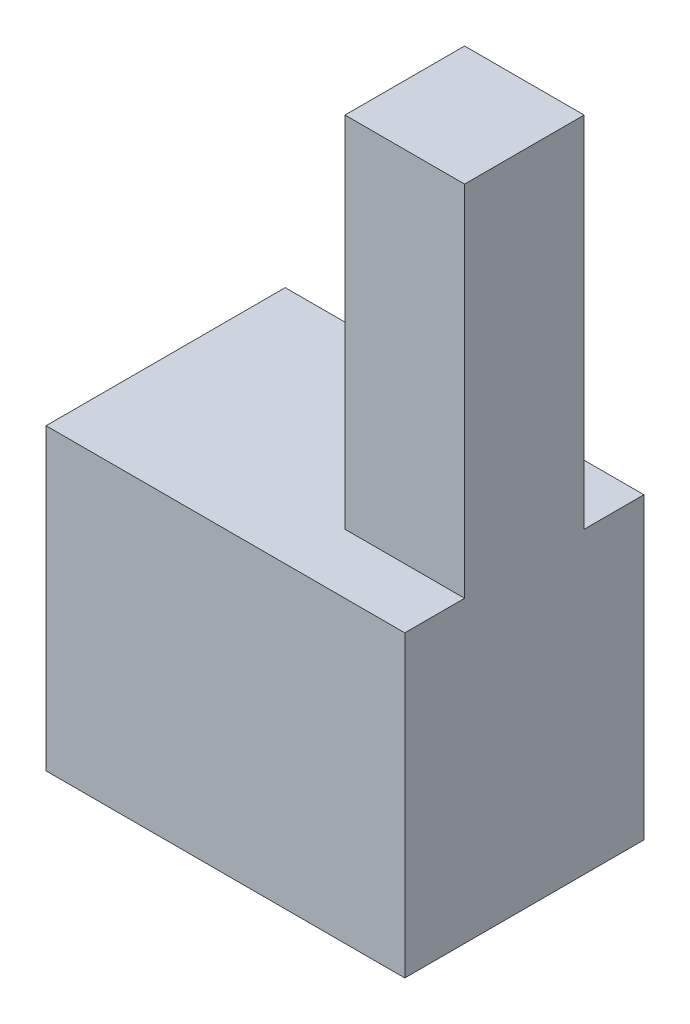
ISO-10303-21;
HEADER;
FILE_DESCRIPTION(('STEP AP214'),'2;1');
FILE_NAME('part.step','',(''),(''),'','','');
FILE_SCHEMA(('AUTOMOTIVE_DESIGN { 1 0 10303 214 1 1 1 1 }'));
ENDSEC;
DATA;
#1=APPLICATION_CONTEXT('core data for automotive mechanical design processes');
#2=APPLICATION_PROTOCOL_DEFINITION('international standard','automotive_design',2000,#1);
#3=PRODUCT_CONTEXT('',#1,'mechanical');
#4=PRODUCT('Part','Part','',(#3));
#5=PRODUCT_RELATED_PRODUCT_CATEGORY('part','',(#4));
#6=PRODUCT_DEFINITION_FORMATION('','',#4);
#7=PRODUCT_DEFINITION_CONTEXT('part definition',#1,'design');
#8=PRODUCT_DEFINITION('design','',#6,#7);
#9=PRODUCT_DEFINITION_SHAPE('','',#8);
#10=(LENGTH_UNIT() NAMED_UNIT(*) SI_UNIT(.MILLI.,.METRE.));
#11=(NAMED_UNIT(*) PLANE_ANGLE_UNIT() SI_UNIT($,.RADIAN.));
#12=(NAMED_UNIT(*) SI_UNIT($,.STERADIAN.) SOLID_ANGLE_UNIT());
#13=UNCERTAINTY_MEASURE_WITH_UNIT(LENGTH_MEASURE(1.E-05),#10,'distance_accuracy_value','');
#14=(GEOMETRIC_REPRESENTATION_CONTEXT(3) GLOBAL_UNCERTAINTY_ASSIGNED_CONTEXT((#13)) GLOBAL_UNIT_ASSIGNED_CONTEXT((#10,
#11,#12)) REPRESENTATION_CONTEXT('',''));
#15=CARTESIAN_POINT('',(0.,0.,0.));
#16=DIRECTION('',(0.,0.,1.));
#17=DIRECTION('',(1.,0.,0.));
#18=AXIS2_PLACEMENT_3D('',#15,#16,#17);
#19=CARTESIAN_POINT('',(0.,0.,0.));
#20=DIRECTION('',(0.,0.,1.));
#21=DIRECTION('',(1.,0.,0.));
#22=AXIS2_PLACEMENT_3D('',#19,#20,#21);
#23=PLANE('',#22);
#24=DIRECTION('',(1.,0.,0.));
#25=VECTOR('',#24,1.);
#26=CARTESIAN_POINT('',(0.,0.,0.));
#27=LINE('',#26,#25);
#28=CARTESIAN_POINT('',(20.,0.,0.));
#29=VERTEX_POINT('',#28);
#30=CARTESIAN_POINT('',(30.,0.,0.));
#31=VERTEX_POINT('',#30);
#32=EDGE_CURVE('E11',#29,#31,#27,.T.);
#33=ORIENTED_EDGE('',*,*,#32,.F.);
#34=DIRECTION('',(0.,-1.,0.));
#35=VECTOR('',#34,1.);
#36=CARTESIAN_POINT('',(20.,0.,0.));
#37=LINE('',#36,#35);
#38=CARTESIAN_POINT('',(20.,30.,0.));
#39=VERTEX_POINT('',#38);
#40=EDGE_CURVE('E145',#39,#29,#37,.T.);
#41=ORIENTED_EDGE('',*,*,#40,.F.);
#42=DIRECTION('',(-1.,0.,0.));
#43=VECTOR('',#42,1.);
#44=CARTESIAN_POINT('',(20.,30.,0.));
#45=LINE('',#44,#43);
#46=CARTESIAN_POINT('',(30.,30.,0.));
#47=VERTEX_POINT('',#46);
#48=EDGE_CURVE('E141',#47,#39,#45,.T.);
#49=ORIENTED_EDGE('',*,*,#48,.F.);
#50=DIRECTION('',(0.,1.,0.));
#51=VECTOR('',#50,1.);
#52=CARTESIAN_POINT('',(30.,30.,0.));
#53=LINE('',#52,#51);
#54=EDGE_CURVE('E123',#31,#47,#53,.T.);
#55=ORIENTED_EDGE('',*,*,#54,.F.);
#56=EDGE_LOOP('',(#33,#41,#49,#55));
#57=FACE_BOUND('',#56,.T.);
#58=ADVANCED_FACE('F47',(#57),#23,.F.);
#59=CARTESIAN_POINT('',(0.,0.,10.));
#60=DIRECTION('',(0.,-1.,0.));
#61=DIRECTION('',(0.,0.,-1.));
#62=AXIS2_PLACEMENT_3D('',#59,#60,#61);
#63=PLANE('',#62);
#64=DIRECTION('',(0.,0.,-1.));
#65=VECTOR('',#64,1.);
#66=CARTESIAN_POINT('',(20.,0.,10.));
#67=LINE('',#66,#65);
#68=CARTESIAN_POINT('',(20.,0.,10.));
#69=VERTEX_POINT('',#68);
#70=EDGE_CURVE('E135',#69,#29,#67,.T.);
#71=ORIENTED_EDGE('',*,*,#70,.T.);
#72=ORIENTED_EDGE('',*,*,#32,.T.);
#73=DIRECTION('',(0.,0.,1.));
#74=VECTOR('',#73,1.);
#75=CARTESIAN_POINT('',(30.,0.,-5.));
#76=LINE('',#75,#74);
#77=CARTESIAN_POINT('',(30.,0.,-5.));
#78=VERTEX_POINT('',#77);
#79=EDGE_CURVE('E194',#78,#31,#76,.T.);
#80=ORIENTED_EDGE('',*,*,#79,.F.);
#81=DIRECTION('',(1.,0.,0.));
#82=VECTOR('',#81,1.);
#83=CARTESIAN_POINT('',(0.,0.,-5.));
#84=LINE('',#83,#82);
#85=CARTESIAN_POINT('',(0.,0.,-5.));
#86=VERTEX_POINT('',#85);
#87=EDGE_CURVE('E189',#86,#78,#84,.T.);
#88=ORIENTED_EDGE('',*,*,#87,.F.);
#89=DIRECTION('',(0.,0.,-1.));
#90=VECTOR('',#89,1.);
#91=CARTESIAN_POINT('',(0.,0.,10.));
#92=LINE('',#91,#90);
#93=CARTESIAN_POINT('',(0.,0.,15.));
#94=VERTEX_POINT('',#93);
#95=EDGE_CURVE('E51',#94,#86,#92,.T.);
#96=ORIENTED_EDGE('',*,*,#95,.F.);
#97=DIRECTION('',(-1.,0.,0.));
#98=VECTOR('',#97,1.);
#99=CARTESIAN_POINT('',(0.,0.,15.));
#100=LINE('',#99,#98);
#101=CARTESIAN_POINT('',(30.,0.,15.));
#102=VERTEX_POINT('',#101);
#103=EDGE_CURVE('E224',#102,#94,#100,.T.);
#104=ORIENTED_EDGE('',*,*,#103,.F.);
#105=DIRECTION('',(0.,0.,-1.));
#106=VECTOR('',#105,1.);
#107=CARTESIAN_POINT('',(30.,0.,15.));
#108=LINE('',#107,#106);
#109=CARTESIAN_POINT('',(30.,0.,10.));
#110=VERTEX_POINT('',#109);
#111=EDGE_CURVE('E227',#102,#110,#108,.T.);
#112=ORIENTED_EDGE('',*,*,#111,.T.);
#113=DIRECTION('',(-1.,0.,0.));
#114=VECTOR('',#113,1.);
#115=CARTESIAN_POINT('',(0.,0.,10.));
#116=LINE('',#115,#114);
#117=EDGE_CURVE('E64',#110,#69,#116,.T.);
#118=ORIENTED_EDGE('',*,*,#117,.T.);
#119=EDGE_LOOP('',(#71,#72,#80,#88,#96,#104,#112,#118));
#120=FACE_BOUND('',#119,.T.);
#121=ADVANCED_FACE('F49',(#120),#63,.F.);
#122=CARTESIAN_POINT('',(0.,0.,10.));
#123=DIRECTION('',(1.,0.,0.));
#124=DIRECTION('',(0.,1.,0.));
#125=AXIS2_PLACEMENT_3D('',#122,#123,#124);
#126=PLANE('',#125);
#127=ORIENTED_EDGE('',*,*,#95,.T.);
#128=DIRECTION('',(0.,1.,0.));
#129=VECTOR('',#128,1.);
#130=CARTESIAN_POINT('',(0.,0.,-5.));
#131=LINE('',#130,#129);
#132=CARTESIAN_POINT('',(0.,-5.,-5.));
#133=VERTEX_POINT('',#132);
#134=EDGE_CURVE('E175',#133,#86,#131,.T.);
#135=ORIENTED_EDGE('',*,*,#134,.F.);
#136=DIRECTION('',(0.,0.,-1.));
#137=VECTOR('',#136,1.);
#138=CARTESIAN_POINT('',(0.,-5.,10.));
#139=LINE('',#138,#137);
#140=CARTESIAN_POINT('',(0.,-5.,10.));
#141=VERTEX_POINT('',#140);
#142=EDGE_CURVE('E96',#141,#133,#139,.T.);
#143=ORIENTED_EDGE('',*,*,#142,.F.);
#144=DIRECTION('',(0.,-1.,0.));
#145=VECTOR('',#144,1.);
#146=CARTESIAN_POINT('',(0.,0.,10.));
#147=LINE('',#146,#145);
#148=CARTESIAN_POINT('',(0.,-25.,10.));
#149=VERTEX_POINT('',#148);
#150=EDGE_CURVE('E213',#141,#149,#147,.T.);
#151=ORIENTED_EDGE('',*,*,#150,.T.);
#152=DIRECTION('',(0.,0.,-1.));
#153=VECTOR('',#152,1.);
#154=CARTESIAN_POINT('',(0.,-25.,15.));
#155=LINE('',#154,#153);
#156=CARTESIAN_POINT('',(0.,-25.,15.));
#157=VERTEX_POINT('',#156);
#158=EDGE_CURVE('E142',#157,#149,#155,.T.);
#159=ORIENTED_EDGE('',*,*,#158,.F.);
#160=DIRECTION('',(0.,-1.,0.));
#161=VECTOR('',#160,1.);
#162=CARTESIAN_POINT('',(0.,0.,15.));
#163=LINE('',#162,#161);
#164=EDGE_CURVE('E178',#94,#157,#163,.T.);
#165=ORIENTED_EDGE('',*,*,#164,.F.);
#166=EDGE_LOOP('',(#127,#135,#143,#151,#159,#165));
#167=FACE_BOUND('',#166,.T.);
#168=ADVANCED_FACE('F174',(#167),#126,.F.);
#169=CARTESIAN_POINT('',(0.,-5.,10.));
#170=DIRECTION('',(0.,1.,0.));
#171=DIRECTION('',(0.,0.,1.));
#172=AXIS2_PLACEMENT_3D('',#169,#170,#171);
#173=PLANE('',#172);
#174=ORIENTED_EDGE('',*,*,#142,.T.);
#175=DIRECTION('',(-1.,0.,0.));
#176=VECTOR('',#175,1.);
#177=CARTESIAN_POINT('',(0.,-5.,-5.));
#178=LINE('',#177,#176);
#179=CARTESIAN_POINT('',(20.,-5.,-5.));
#180=VERTEX_POINT('',#179);
#181=EDGE_CURVE('E192',#180,#133,#178,.T.);
#182=ORIENTED_EDGE('',*,*,#181,.F.);
#183=DIRECTION('',(0.,0.,-1.));
#184=VECTOR('',#183,1.);
#185=CARTESIAN_POINT('',(20.,-5.,10.));
#186=LINE('',#185,#184);
#187=CARTESIAN_POINT('',(20.,-5.,10.));
#188=VERTEX_POINT('',#187);
#189=EDGE_CURVE('E160',#188,#180,#186,.T.);
#190=ORIENTED_EDGE('',*,*,#189,.F.);
#191=DIRECTION('',(1.,0.,0.));
#192=VECTOR('',#191,1.);
#193=CARTESIAN_POINT('',(0.,-5.,10.));
#194=LINE('',#193,#192);
#195=EDGE_CURVE('E148',#141,#188,#194,.T.);
#196=ORIENTED_EDGE('',*,*,#195,.F.);
#197=EDGE_LOOP('',(#174,#182,#190,#196));
#198=FACE_BOUND('',#197,.T.);
#199=ADVANCED_FACE('F280',(#198),#173,.F.);
#200=CARTESIAN_POINT('',(20.,-5.,10.));
#201=DIRECTION('',(1.,0.,0.));
#202=DIRECTION('',(0.,0.,-1.));
#203=AXIS2_PLACEMENT_3D('',#200,#201,#202);
#204=PLANE('',#203);
#205=ORIENTED_EDGE('',*,*,#189,.T.);
#206=DIRECTION('',(0.,1.,0.));
#207=VECTOR('',#206,1.);
#208=CARTESIAN_POINT('',(20.,0.,-5.));
#209=LINE('',#208,#207);
#210=CARTESIAN_POINT('',(20.,-25.,-5.));
#211=VERTEX_POINT('',#210);
#212=EDGE_CURVE('E206',#211,#180,#209,.T.);
#213=ORIENTED_EDGE('',*,*,#212,.F.);
#214=DIRECTION('',(0.,0.,-1.));
#215=VECTOR('',#214,1.);
#216=CARTESIAN_POINT('',(20.,-25.,10.));
#217=LINE('',#216,#215);
#218=CARTESIAN_POINT('',(20.,-25.,10.));
#219=VERTEX_POINT('',#218);
#220=EDGE_CURVE('E156',#219,#211,#217,.T.);
#221=ORIENTED_EDGE('',*,*,#220,.F.);
#222=DIRECTION('',(0.,-1.,0.));
#223=VECTOR('',#222,1.);
#224=CARTESIAN_POINT('',(20.,-5.,10.));
#225=LINE('',#224,#223);
#226=EDGE_CURVE('E116',#188,#219,#225,.T.);
#227=ORIENTED_EDGE('',*,*,#226,.F.);
#228=EDGE_LOOP('',(#205,#213,#221,#227));
#229=FACE_BOUND('',#228,.T.);
#230=ADVANCED_FACE('F279',(#229),#204,.F.);
#231=CARTESIAN_POINT('',(30.,-25.,10.));
#232=DIRECTION('',(0.,1.,0.));
#233=DIRECTION('',(0.,0.,1.));
#234=AXIS2_PLACEMENT_3D('',#231,#232,#233);
#235=PLANE('',#234);
#236=ORIENTED_EDGE('',*,*,#220,.T.);
#237=DIRECTION('',(-1.,0.,0.));
#238=VECTOR('',#237,1.);
#239=CARTESIAN_POINT('',(0.,-25.,-5.));
#240=LINE('',#239,#238);
#241=CARTESIAN_POINT('',(30.,-25.,-5.));
#242=VERTEX_POINT('',#241);
#243=EDGE_CURVE('E200',#242,#211,#240,.T.);
#244=ORIENTED_EDGE('',*,*,#243,.F.);
#245=DIRECTION('',(0.,0.,-1.));
#246=VECTOR('',#245,1.);
#247=CARTESIAN_POINT('',(30.,-25.,10.));
#248=LINE('',#247,#246);
#249=CARTESIAN_POINT('',(30.,-25.,15.));
#250=VERTEX_POINT('',#249);
#251=EDGE_CURVE('E127',#250,#242,#248,.T.);
#252=ORIENTED_EDGE('',*,*,#251,.F.);
#253=DIRECTION('',(1.,0.,0.));
#254=VECTOR('',#253,1.);
#255=CARTESIAN_POINT('',(0.,-25.,15.));
#256=LINE('',#255,#254);
#257=EDGE_CURVE('E216',#157,#250,#256,.T.);
#258=ORIENTED_EDGE('',*,*,#257,.F.);
#259=ORIENTED_EDGE('',*,*,#158,.T.);
#260=DIRECTION('',(1.,0.,0.));
#261=VECTOR('',#260,1.);
#262=CARTESIAN_POINT('',(0.,-25.,10.));
#263=LINE('',#262,#261);
#264=EDGE_CURVE('E230',#149,#219,#263,.T.);
#265=ORIENTED_EDGE('',*,*,#264,.T.);
#266=EDGE_LOOP('',(#236,#244,#252,#258,#259,#265));
#267=FACE_BOUND('',#266,.T.);
#268=ADVANCED_FACE('F252',(#267),#235,.F.);
#269=CARTESIAN_POINT('',(30.,30.,10.));
#270=DIRECTION('',(-1.,0.,0.));
#271=DIRECTION('',(0.,0.,1.));
#272=AXIS2_PLACEMENT_3D('',#269,#270,#271);
#273=PLANE('',#272);
#274=ORIENTED_EDGE('',*,*,#251,.T.);
#275=DIRECTION('',(0.,-1.,0.));
#276=VECTOR('',#275,1.);
#277=CARTESIAN_POINT('',(30.,0.,-5.));
#278=LINE('',#277,#276);
#279=EDGE_CURVE('E197',#78,#242,#278,.T.);
#280=ORIENTED_EDGE('',*,*,#279,.F.);
#281=ORIENTED_EDGE('',*,*,#79,.T.);
#282=ORIENTED_EDGE('',*,*,#54,.T.);
#283=DIRECTION('',(0.,0.,-1.));
#284=VECTOR('',#283,1.);
#285=CARTESIAN_POINT('',(30.,30.,10.));
#286=LINE('',#285,#284);
#287=CARTESIAN_POINT('',(30.,30.,10.));
#288=VERTEX_POINT('',#287);
#289=EDGE_CURVE('E119',#288,#47,#286,.T.);
#290=ORIENTED_EDGE('',*,*,#289,.F.);
#291=DIRECTION('',(0.,1.,0.));
#292=VECTOR('',#291,1.);
#293=CARTESIAN_POINT('',(30.,30.,10.));
#294=LINE('',#293,#292);
#295=EDGE_CURVE('E106',#110,#288,#294,.T.);
#296=ORIENTED_EDGE('',*,*,#295,.F.);
#297=ORIENTED_EDGE('',*,*,#111,.F.);
#298=DIRECTION('',(0.,1.,0.));
#299=VECTOR('',#298,1.);
#300=CARTESIAN_POINT('',(30.,0.,15.));
#301=LINE('',#300,#299);
#302=EDGE_CURVE('E220',#250,#102,#301,.T.);
#303=ORIENTED_EDGE('',*,*,#302,.F.);
#304=EDGE_LOOP('',(#274,#280,#281,#282,#290,#296,#297,#303));
#305=FACE_BOUND('',#304,.T.);
#306=ADVANCED_FACE('F121',(#305),#273,.F.);
#307=CARTESIAN_POINT('',(20.,30.,10.));
#308=DIRECTION('',(0.,-1.,0.));
#309=DIRECTION('',(0.,0.,-1.));
#310=AXIS2_PLACEMENT_3D('',#307,#308,#309);
#311=PLANE('',#310);
#312=ORIENTED_EDGE('',*,*,#48,.T.);
#313=DIRECTION('',(0.,0.,-1.));
#314=VECTOR('',#313,1.);
#315=CARTESIAN_POINT('',(20.,30.,10.));
#316=LINE('',#315,#314);
#317=CARTESIAN_POINT('',(20.,30.,10.));
#318=VERTEX_POINT('',#317);
#319=EDGE_CURVE('E128',#318,#39,#316,.T.);
#320=ORIENTED_EDGE('',*,*,#319,.F.);
#321=DIRECTION('',(-1.,0.,0.));
#322=VECTOR('',#321,1.);
#323=CARTESIAN_POINT('',(20.,30.,10.));
#324=LINE('',#323,#322);
#325=EDGE_CURVE('E110',#288,#318,#324,.T.);
#326=ORIENTED_EDGE('',*,*,#325,.F.);
#327=ORIENTED_EDGE('',*,*,#289,.T.);
#328=EDGE_LOOP('',(#312,#320,#326,#327));
#329=FACE_BOUND('',#328,.T.);
#330=ADVANCED_FACE('F130',(#329),#311,.F.);
#331=CARTESIAN_POINT('',(20.,0.,10.));
#332=DIRECTION('',(1.,0.,0.));
#333=DIRECTION('',(0.,0.,-1.));
#334=AXIS2_PLACEMENT_3D('',#331,#332,#333);
#335=PLANE('',#334);
#336=ORIENTED_EDGE('',*,*,#40,.T.);
#337=ORIENTED_EDGE('',*,*,#70,.F.);
#338=DIRECTION('',(0.,-1.,0.));
#339=VECTOR('',#338,1.);
#340=CARTESIAN_POINT('',(20.,0.,10.));
#341=LINE('',#340,#339);
#342=EDGE_CURVE('E70',#318,#69,#341,.T.);
#343=ORIENTED_EDGE('',*,*,#342,.F.);
#344=ORIENTED_EDGE('',*,*,#319,.T.);
#345=EDGE_LOOP('',(#336,#337,#343,#344));
#346=FACE_BOUND('',#345,.T.);
#347=ADVANCED_FACE('F269',(#346),#335,.F.);
#348=CARTESIAN_POINT('',(0.,0.,10.));
#349=DIRECTION('',(0.,0.,1.));
#350=DIRECTION('',(1.,0.,0.));
#351=AXIS2_PLACEMENT_3D('',#348,#349,#350);
#352=PLANE('',#351);
#353=ORIENTED_EDGE('',*,*,#117,.F.);
#354=ORIENTED_EDGE('',*,*,#295,.T.);
#355=ORIENTED_EDGE('',*,*,#325,.T.);
#356=ORIENTED_EDGE('',*,*,#342,.T.);
#357=EDGE_LOOP('',(#353,#354,#355,#356));
#358=FACE_BOUND('',#357,.T.);
#359=ADVANCED_FACE('F108',(#358),#352,.T.);
#360=CARTESIAN_POINT('',(0.,0.,10.));
#361=DIRECTION('',(0.,0.,1.));
#362=DIRECTION('',(1.,0.,0.));
#363=AXIS2_PLACEMENT_3D('',#360,#361,#362);
#364=PLANE('',#363);
#365=ORIENTED_EDGE('',*,*,#150,.F.);
#366=ORIENTED_EDGE('',*,*,#195,.T.);
#367=ORIENTED_EDGE('',*,*,#226,.T.);
#368=ORIENTED_EDGE('',*,*,#264,.F.);
#369=EDGE_LOOP('',(#365,#366,#367,#368));
#370=FACE_BOUND('',#369,.T.);
#371=ADVANCED_FACE('F249',(#370),#364,.F.);
#372=CARTESIAN_POINT('',(0.,0.,15.));
#373=DIRECTION('',(0.,0.,1.));
#374=DIRECTION('',(1.,0.,0.));
#375=AXIS2_PLACEMENT_3D('',#372,#373,#374);
#376=PLANE('',#375);
#377=ORIENTED_EDGE('',*,*,#164,.T.);
#378=ORIENTED_EDGE('',*,*,#257,.T.);
#379=ORIENTED_EDGE('',*,*,#302,.T.);
#380=ORIENTED_EDGE('',*,*,#103,.T.);
#381=EDGE_LOOP('',(#377,#378,#379,#380));
#382=FACE_BOUND('',#381,.T.);
#383=ADVANCED_FACE('F267',(#382),#376,.T.);
#384=CARTESIAN_POINT('',(0.,0.,-5.));
#385=DIRECTION('',(0.,0.,-1.));
#386=DIRECTION('',(-1.,0.,0.));
#387=AXIS2_PLACEMENT_3D('',#384,#385,#386);
#388=PLANE('',#387);
#389=ORIENTED_EDGE('',*,*,#87,.T.);
#390=ORIENTED_EDGE('',*,*,#279,.T.);
#391=ORIENTED_EDGE('',*,*,#243,.T.);
#392=ORIENTED_EDGE('',*,*,#212,.T.);
#393=ORIENTED_EDGE('',*,*,#181,.T.);
#394=ORIENTED_EDGE('',*,*,#134,.T.);
#395=EDGE_LOOP('',(#389,#390,#391,#392,#393,#394));
#396=FACE_BOUND('',#395,.T.);
#397=ADVANCED_FACE('F186',(#396),#388,.T.);
#398=CLOSED_SHELL('',(#58,#121,#168,#199,#230,#268,#306,#330,#347,#359,#371,#383,#397));
#399=MANIFOLD_SOLID_BREP('B2',#398);
#400=ADVANCED_BREP_SHAPE_REPRESENTATION('',(#18,#399),#14);
#401=SHAPE_DEFINITION_REPRESENTATION(#9,#400);
ENDSEC;
END-ISO-10303-21;
